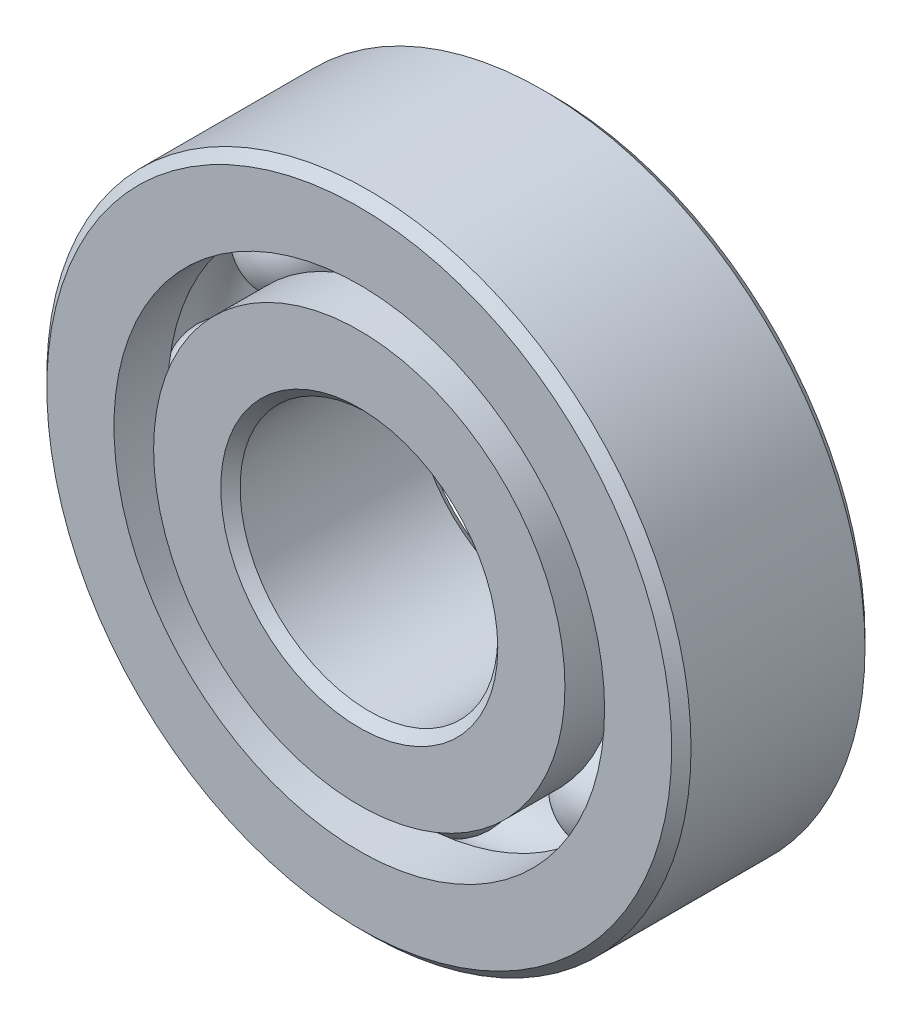
ISO-10303-21;
HEADER;
FILE_DESCRIPTION(('STEP AP214'),'2;1');
FILE_NAME('part.step','',(''),(''),'','','');
FILE_SCHEMA(('AUTOMOTIVE_DESIGN { 1 0 10303 214 1 1 1 1 }'));
ENDSEC;
DATA;
#1=APPLICATION_CONTEXT('core data for automotive mechanical design processes');
#2=APPLICATION_PROTOCOL_DEFINITION('international standard','automotive_design',2000,#1);
#3=PRODUCT_CONTEXT('',#1,'mechanical');
#4=PRODUCT('Part','Part','',(#3));
#5=PRODUCT_RELATED_PRODUCT_CATEGORY('part','',(#4));
#6=PRODUCT_DEFINITION_FORMATION('','',#4);
#7=PRODUCT_DEFINITION_CONTEXT('part definition',#1,'design');
#8=PRODUCT_DEFINITION('design','',#6,#7);
#9=PRODUCT_DEFINITION_SHAPE('','',#8);
#10=(LENGTH_UNIT() NAMED_UNIT(*) SI_UNIT(.MILLI.,.METRE.));
#11=(NAMED_UNIT(*) PLANE_ANGLE_UNIT() SI_UNIT($,.RADIAN.));
#12=(NAMED_UNIT(*) SI_UNIT($,.STERADIAN.) SOLID_ANGLE_UNIT());
#13=UNCERTAINTY_MEASURE_WITH_UNIT(LENGTH_MEASURE(1.E-05),#10,'distance_accuracy_value','');
#14=(GEOMETRIC_REPRESENTATION_CONTEXT(3) GLOBAL_UNCERTAINTY_ASSIGNED_CONTEXT((#13)) GLOBAL_UNIT_ASSIGNED_CONTEXT((#10,
#11,#12)) REPRESENTATION_CONTEXT('',''));
#15=CARTESIAN_POINT('',(0.,0.,0.));
#16=DIRECTION('',(0.,0.,1.));
#17=DIRECTION('',(1.,0.,0.));
#18=AXIS2_PLACEMENT_3D('',#15,#16,#17);
#19=CARTESIAN_POINT('',(-3.92886205296771,3.9288620529678,0.));
#20=DIRECTION('',(0.,0.,1.));
#21=DIRECTION('',(-0.707106781186539,0.707106781186556,0.));
#22=AXIS2_PLACEMENT_3D('',#19,#20,#21);
#23=SPHERICAL_SURFACE('',#22,1.1656174839975);
#24=CARTESIAN_POINT('',(-3.92886205296771,3.9288620529678,1.1656174839975));
#25=VERTEX_POINT('',#24);
#26=VERTEX_LOOP('',#25);
#27=FACE_BOUND('',#26,.T.);
#28=ADVANCED_FACE('F37',(#27),#23,.T.);
#29=CLOSED_SHELL('',(#28));
#30=MANIFOLD_SOLID_BREP('B2',#29);
#31=CARTESIAN_POINT('',(-5.55625,0.,0.));
#32=DIRECTION('',(0.,0.,1.));
#33=DIRECTION('',(-1.,0.,0.));
#34=AXIS2_PLACEMENT_3D('',#31,#32,#33);
#35=SPHERICAL_SURFACE('',#34,1.1656174839975);
#36=CARTESIAN_POINT('',(-5.55625,0.,1.1656174839975));
#37=VERTEX_POINT('',#36);
#38=VERTEX_LOOP('',#37);
#39=FACE_BOUND('',#38,.T.);
#40=ADVANCED_FACE('F57',(#39),#35,.T.);
#41=CLOSED_SHELL('',(#40));
#42=MANIFOLD_SOLID_BREP('B6',#41);
#43=CARTESIAN_POINT('',(-3.92886205296779,-3.92886205296772,0.));
#44=DIRECTION('',(0.,0.,1.));
#45=DIRECTION('',(-0.707106781186554,-0.707106781186541,0.));
#46=AXIS2_PLACEMENT_3D('',#43,#44,#45);
#47=SPHERICAL_SURFACE('',#46,1.1656174839975);
#48=CARTESIAN_POINT('',(-3.92886205296779,-3.92886205296772,1.1656174839975));
#49=VERTEX_POINT('',#48);
#50=VERTEX_LOOP('',#49);
#51=FACE_BOUND('',#50,.T.);
#52=ADVANCED_FACE('F77',(#51),#47,.T.);
#53=CLOSED_SHELL('',(#52));
#54=MANIFOLD_SOLID_BREP('B33',#53);
#55=CARTESIAN_POINT('',(0.,-5.55625,0.));
#56=DIRECTION('',(0.,0.,1.));
#57=DIRECTION('',(0.,-1.,0.));
#58=AXIS2_PLACEMENT_3D('',#55,#56,#57);
#59=SPHERICAL_SURFACE('',#58,1.1656174839975);
#60=CARTESIAN_POINT('',(0.,-5.55625,1.1656174839975));
#61=VERTEX_POINT('',#60);
#62=VERTEX_LOOP('',#61);
#63=FACE_BOUND('',#62,.T.);
#64=ADVANCED_FACE('F97',(#63),#59,.T.);
#65=CLOSED_SHELL('',(#64));
#66=MANIFOLD_SOLID_BREP('B53',#65);
#67=CARTESIAN_POINT('',(3.92886205296773,-3.92886205296777,0.));
#68=DIRECTION('',(0.,0.,1.));
#69=DIRECTION('',(0.707106781186544,-0.707106781186551,0.));
#70=AXIS2_PLACEMENT_3D('',#67,#68,#69);
#71=SPHERICAL_SURFACE('',#70,1.1656174839975);
#72=CARTESIAN_POINT('',(3.92886205296773,-3.92886205296777,1.1656174839975));
#73=VERTEX_POINT('',#72);
#74=VERTEX_LOOP('',#73);
#75=FACE_BOUND('',#74,.T.);
#76=ADVANCED_FACE('F117',(#75),#71,.T.);
#77=CLOSED_SHELL('',(#76));
#78=MANIFOLD_SOLID_BREP('B73',#77);
#79=CARTESIAN_POINT('',(5.55625,0.,0.));
#80=DIRECTION('',(0.,0.,1.));
#81=DIRECTION('',(1.,0.,0.));
#82=AXIS2_PLACEMENT_3D('',#79,#80,#81);
#83=SPHERICAL_SURFACE('',#82,1.1656174839975);
#84=CARTESIAN_POINT('',(5.55625,0.,1.1656174839975));
#85=VERTEX_POINT('',#84);
#86=VERTEX_LOOP('',#85);
#87=FACE_BOUND('',#86,.T.);
#88=ADVANCED_FACE('F137',(#87),#83,.T.);
#89=CLOSED_SHELL('',(#88));
#90=MANIFOLD_SOLID_BREP('B93',#89);
#91=CARTESIAN_POINT('',(3.92886205296776,3.92886205296775,0.));
#92=DIRECTION('',(0.,0.,1.));
#93=DIRECTION('',(0.707106781186549,0.707106781186546,0.));
#94=AXIS2_PLACEMENT_3D('',#91,#92,#93);
#95=SPHERICAL_SURFACE('',#94,1.1656174839975);
#96=CARTESIAN_POINT('',(3.92886205296776,3.92886205296775,1.1656174839975));
#97=VERTEX_POINT('',#96);
#98=VERTEX_LOOP('',#97);
#99=FACE_BOUND('',#98,.T.);
#100=ADVANCED_FACE('F157',(#99),#95,.T.);
#101=CLOSED_SHELL('',(#100));
#102=MANIFOLD_SOLID_BREP('B113',#101);
#103=CARTESIAN_POINT('',(0.,5.55625,0.));
#104=DIRECTION('',(0.,0.,1.));
#105=DIRECTION('',(0.,1.,0.));
#106=AXIS2_PLACEMENT_3D('',#103,#104,#105);
#107=SPHERICAL_SURFACE('',#106,1.1656174839975);
#108=CARTESIAN_POINT('',(0.,5.55625,1.1656174839975));
#109=VERTEX_POINT('',#108);
#110=VERTEX_LOOP('',#109);
#111=FACE_BOUND('',#110,.T.);
#112=ADVANCED_FACE('F179',(#111),#107,.T.);
#113=CLOSED_SHELL('',(#112));
#114=MANIFOLD_SOLID_BREP('B133',#113);
#115=CARTESIAN_POINT('',(0.,5.06778846153846,2.38125));
#116=DIRECTION('',(0.,0.,-1.));
#117=DIRECTION('',(-1.,0.,0.));
#118=AXIS2_PLACEMENT_3D('',#115,#116,#117);
#119=PLANE('',#118);
#120=CARTESIAN_POINT('',(0.,0.,2.38125));
#121=DIRECTION('',(0.,0.,1.));
#122=DIRECTION('',(1.,0.,0.));
#123=AXIS2_PLACEMENT_3D('',#120,#121,#122);
#124=CIRCLE('',#123,3.413125);
#125=CARTESIAN_POINT('',(3.413125,0.,2.38125));
#126=VERTEX_POINT('',#125);
#127=EDGE_CURVE('E226',#126,#126,#124,.T.);
#128=ORIENTED_EDGE('',*,*,#127,.F.);
#129=EDGE_LOOP('',(#128));
#130=FACE_BOUND('',#129,.T.);
#131=CARTESIAN_POINT('',(0.,0.,2.38125));
#132=DIRECTION('',(0.,0.,1.));
#133=DIRECTION('',(1.,0.,0.));
#134=AXIS2_PLACEMENT_3D('',#131,#132,#133);
#135=CIRCLE('',#134,5.06778846153846);
#136=CARTESIAN_POINT('',(5.06778846153846,0.,2.38125));
#137=VERTEX_POINT('',#136);
#138=EDGE_CURVE('E178',#137,#137,#135,.T.);
#139=ORIENTED_EDGE('',*,*,#138,.T.);
#140=EDGE_LOOP('',(#139));
#141=FACE_BOUND('',#140,.T.);
#142=ADVANCED_FACE('F198',(#130,#141),#119,.F.);
#143=CARTESIAN_POINT('',(0.,0.,2.38125));
#144=DIRECTION('',(0.,0.,1.));
#145=DIRECTION('',(1.,0.,0.));
#146=AXIS2_PLACEMENT_3D('',#143,#144,#145);
#147=CYLINDRICAL_SURFACE('',#146,5.06778846153846);
#148=ORIENTED_EDGE('',*,*,#138,.F.);
#149=EDGE_LOOP('',(#148));
#150=FACE_BOUND('',#149,.T.);
#151=CARTESIAN_POINT('',(0.,0.,1.05833333333333));
#152=DIRECTION('',(0.,0.,1.));
#153=DIRECTION('',(1.,0.,0.));
#154=AXIS2_PLACEMENT_3D('',#151,#152,#153);
#155=CIRCLE('',#154,5.06778846153846);
#156=CARTESIAN_POINT('',(5.06778846153846,0.,1.05833333333333));
#157=VERTEX_POINT('',#156);
#158=EDGE_CURVE('E204',#157,#157,#155,.T.);
#159=ORIENTED_EDGE('',*,*,#158,.T.);
#160=EDGE_LOOP('',(#159));
#161=FACE_BOUND('',#160,.T.);
#162=ADVANCED_FACE('F233',(#150,#161),#147,.T.);
#163=CARTESIAN_POINT('',(0.,0.,0.));
#164=DIRECTION('',(0.,0.,1.));
#165=DIRECTION('',(1.,0.,0.));
#166=AXIS2_PLACEMENT_3D('',#163,#164,#165);
#167=TOROIDAL_SURFACE('',#166,5.55625,1.16561748399749);
#168=ORIENTED_EDGE('',*,*,#158,.F.);
#169=EDGE_LOOP('',(#168));
#170=FACE_BOUND('',#169,.T.);
#171=CARTESIAN_POINT('',(0.,0.,-1.05833333333333));
#172=DIRECTION('',(0.,0.,1.));
#173=DIRECTION('',(1.,0.,0.));
#174=AXIS2_PLACEMENT_3D('',#171,#172,#173);
#175=CIRCLE('',#174,5.06778846153846);
#176=CARTESIAN_POINT('',(5.06778846153846,0.,-1.05833333333333));
#177=VERTEX_POINT('',#176);
#178=EDGE_CURVE('E208',#177,#177,#175,.T.);
#179=ORIENTED_EDGE('',*,*,#178,.T.);
#180=EDGE_LOOP('',(#179));
#181=FACE_BOUND('',#180,.T.);
#182=ADVANCED_FACE('F237',(#170,#181),#167,.F.);
#183=CARTESIAN_POINT('',(0.,0.,2.38125));
#184=DIRECTION('',(0.,0.,1.));
#185=DIRECTION('',(1.,0.,0.));
#186=AXIS2_PLACEMENT_3D('',#183,#184,#185);
#187=CYLINDRICAL_SURFACE('',#186,5.06778846153846);
#188=ORIENTED_EDGE('',*,*,#178,.F.);
#189=EDGE_LOOP('',(#188));
#190=FACE_BOUND('',#189,.T.);
#191=CARTESIAN_POINT('',(0.,0.,-2.38125));
#192=DIRECTION('',(0.,0.,1.));
#193=DIRECTION('',(1.,0.,0.));
#194=AXIS2_PLACEMENT_3D('',#191,#192,#193);
#195=CIRCLE('',#194,5.06778846153846);
#196=CARTESIAN_POINT('',(5.06778846153846,0.,-2.38125));
#197=VERTEX_POINT('',#196);
#198=EDGE_CURVE('E212',#197,#197,#195,.T.);
#199=ORIENTED_EDGE('',*,*,#198,.T.);
#200=EDGE_LOOP('',(#199));
#201=FACE_BOUND('',#200,.T.);
#202=ADVANCED_FACE('F242',(#190,#201),#187,.T.);
#203=CARTESIAN_POINT('',(0.,3.413125,-2.38125000000001));
#204=DIRECTION('',(0.,0.,1.));
#205=DIRECTION('',(1.,0.,0.));
#206=AXIS2_PLACEMENT_3D('',#203,#204,#205);
#207=PLANE('',#206);
#208=ORIENTED_EDGE('',*,*,#198,.F.);
#209=EDGE_LOOP('',(#208));
#210=FACE_BOUND('',#209,.T.);
#211=CARTESIAN_POINT('',(0.,0.,-2.38125000000001));
#212=DIRECTION('',(0.,0.,1.));
#213=DIRECTION('',(1.,0.,0.));
#214=AXIS2_PLACEMENT_3D('',#211,#212,#213);
#215=CIRCLE('',#214,3.413125);
#216=CARTESIAN_POINT('',(3.413125,0.,-2.38125000000001));
#217=VERTEX_POINT('',#216);
#218=EDGE_CURVE('E217',#217,#217,#215,.T.);
#219=ORIENTED_EDGE('',*,*,#218,.T.);
#220=EDGE_LOOP('',(#219));
#221=FACE_BOUND('',#220,.T.);
#222=ADVANCED_FACE('F248',(#210,#221),#207,.F.);
#223=CARTESIAN_POINT('',(0.,0.,-2.14312500000001));
#224=DIRECTION('',(0.,0.,-1.));
#225=DIRECTION('',(-1.,0.,0.));
#226=AXIS2_PLACEMENT_3D('',#223,#224,#225);
#227=CONICAL_SURFACE('',#226,3.175,0.785398163397443);
#228=ORIENTED_EDGE('',*,*,#218,.F.);
#229=EDGE_LOOP('',(#228));
#230=FACE_BOUND('',#229,.T.);
#231=CARTESIAN_POINT('',(0.,0.,-2.14312500000001));
#232=DIRECTION('',(0.,0.,1.));
#233=DIRECTION('',(1.,0.,0.));
#234=AXIS2_PLACEMENT_3D('',#231,#232,#233);
#235=CIRCLE('',#234,3.175);
#236=CARTESIAN_POINT('',(3.175,0.,-2.14312500000001));
#237=VERTEX_POINT('',#236);
#238=EDGE_CURVE('E220',#237,#237,#235,.T.);
#239=ORIENTED_EDGE('',*,*,#238,.T.);
#240=EDGE_LOOP('',(#239));
#241=FACE_BOUND('',#240,.T.);
#242=ADVANCED_FACE('F252',(#230,#241),#227,.F.);
#243=CARTESIAN_POINT('',(0.,0.,2.38125));
#244=DIRECTION('',(0.,0.,1.));
#245=DIRECTION('',(1.,0.,0.));
#246=AXIS2_PLACEMENT_3D('',#243,#244,#245);
#247=CYLINDRICAL_SURFACE('',#246,3.175);
#248=ORIENTED_EDGE('',*,*,#238,.F.);
#249=EDGE_LOOP('',(#248));
#250=FACE_BOUND('',#249,.T.);
#251=CARTESIAN_POINT('',(0.,0.,2.14312500000001));
#252=DIRECTION('',(0.,0.,1.));
#253=DIRECTION('',(1.,0.,0.));
#254=AXIS2_PLACEMENT_3D('',#251,#252,#253);
#255=CIRCLE('',#254,3.175);
#256=CARTESIAN_POINT('',(3.175,0.,2.14312500000001));
#257=VERTEX_POINT('',#256);
#258=EDGE_CURVE('E223',#257,#257,#255,.T.);
#259=ORIENTED_EDGE('',*,*,#258,.T.);
#260=EDGE_LOOP('',(#259));
#261=FACE_BOUND('',#260,.T.);
#262=ADVANCED_FACE('F256',(#250,#261),#247,.F.);
#263=CARTESIAN_POINT('',(0.,0.,2.38125));
#264=DIRECTION('',(0.,0.,1.));
#265=DIRECTION('',(1.,0.,0.));
#266=AXIS2_PLACEMENT_3D('',#263,#264,#265);
#267=CONICAL_SURFACE('',#266,3.413125,0.785398163397459);
#268=ORIENTED_EDGE('',*,*,#258,.F.);
#269=EDGE_LOOP('',(#268));
#270=FACE_BOUND('',#269,.T.);
#271=ORIENTED_EDGE('',*,*,#127,.T.);
#272=EDGE_LOOP('',(#271));
#273=FACE_BOUND('',#272,.T.);
#274=ADVANCED_FACE('F230',(#270,#273),#267,.F.);
#275=CLOSED_SHELL('',(#142,#162,#182,#202,#222,#242,#262,#274));
#276=MANIFOLD_SOLID_BREP('B153',#275);
#277=CARTESIAN_POINT('',(0.,0.,2.143125));
#278=DIRECTION('',(0.,0.,-1.));
#279=DIRECTION('',(-1.,0.,0.));
#280=AXIS2_PLACEMENT_3D('',#277,#278,#279);
#281=CONICAL_SURFACE('',#280,7.9375,0.785398163397446);
#282=CARTESIAN_POINT('',(0.,0.,2.38125));
#283=DIRECTION('',(0.,0.,1.));
#284=DIRECTION('',(1.,0.,0.));
#285=AXIS2_PLACEMENT_3D('',#282,#283,#284);
#286=CIRCLE('',#285,7.699375);
#287=CARTESIAN_POINT('',(7.699375,0.,2.38125));
#288=VERTEX_POINT('',#287);
#289=EDGE_CURVE('E347',#288,#288,#286,.T.);
#290=ORIENTED_EDGE('',*,*,#289,.F.);
#291=EDGE_LOOP('',(#290));
#292=FACE_BOUND('',#291,.T.);
#293=CARTESIAN_POINT('',(0.,0.,2.143125));
#294=DIRECTION('',(0.,0.,1.));
#295=DIRECTION('',(1.,0.,0.));
#296=AXIS2_PLACEMENT_3D('',#293,#294,#295);
#297=CIRCLE('',#296,7.9375);
#298=CARTESIAN_POINT('',(7.9375,0.,2.143125));
#299=VERTEX_POINT('',#298);
#300=EDGE_CURVE('E197',#299,#299,#297,.T.);
#301=ORIENTED_EDGE('',*,*,#300,.T.);
#302=EDGE_LOOP('',(#301));
#303=FACE_BOUND('',#302,.T.);
#304=ADVANCED_FACE('F319',(#292,#303),#281,.T.);
#305=CARTESIAN_POINT('',(0.,0.,2.38125));
#306=DIRECTION('',(0.,0.,1.));
#307=DIRECTION('',(1.,0.,0.));
#308=AXIS2_PLACEMENT_3D('',#305,#306,#307);
#309=CYLINDRICAL_SURFACE('',#308,7.9375);
#310=ORIENTED_EDGE('',*,*,#300,.F.);
#311=EDGE_LOOP('',(#310));
#312=FACE_BOUND('',#311,.T.);
#313=CARTESIAN_POINT('',(0.,0.,-2.14312500000001));
#314=DIRECTION('',(0.,0.,1.));
#315=DIRECTION('',(1.,0.,0.));
#316=AXIS2_PLACEMENT_3D('',#313,#314,#315);
#317=CIRCLE('',#316,7.9375);
#318=CARTESIAN_POINT('',(7.9375,0.,-2.14312500000001));
#319=VERTEX_POINT('',#318);
#320=EDGE_CURVE('E325',#319,#319,#317,.T.);
#321=ORIENTED_EDGE('',*,*,#320,.T.);
#322=EDGE_LOOP('',(#321));
#323=FACE_BOUND('',#322,.T.);
#324=ADVANCED_FACE('F354',(#312,#323),#309,.T.);
#325=CARTESIAN_POINT('',(0.,0.,-2.38125000000001));
#326=DIRECTION('',(0.,0.,1.));
#327=DIRECTION('',(1.,0.,0.));
#328=AXIS2_PLACEMENT_3D('',#325,#326,#327);
#329=CONICAL_SURFACE('',#328,7.699375,0.785398163397445);
#330=ORIENTED_EDGE('',*,*,#320,.F.);
#331=EDGE_LOOP('',(#330));
#332=FACE_BOUND('',#331,.T.);
#333=CARTESIAN_POINT('',(0.,0.,-2.38125000000001));
#334=DIRECTION('',(0.,0.,1.));
#335=DIRECTION('',(1.,0.,0.));
#336=AXIS2_PLACEMENT_3D('',#333,#334,#335);
#337=CIRCLE('',#336,7.699375);
#338=CARTESIAN_POINT('',(7.699375,0.,-2.38125000000001));
#339=VERTEX_POINT('',#338);
#340=EDGE_CURVE('E329',#339,#339,#337,.T.);
#341=ORIENTED_EDGE('',*,*,#340,.T.);
#342=EDGE_LOOP('',(#341));
#343=FACE_BOUND('',#342,.T.);
#344=ADVANCED_FACE('F358',(#332,#343),#329,.T.);
#345=CARTESIAN_POINT('',(0.,7.699375,-2.38125000000001));
#346=DIRECTION('',(0.,0.,1.));
#347=DIRECTION('',(1.,0.,0.));
#348=AXIS2_PLACEMENT_3D('',#345,#346,#347);
#349=PLANE('',#348);
#350=ORIENTED_EDGE('',*,*,#340,.F.);
#351=EDGE_LOOP('',(#350));
#352=FACE_BOUND('',#351,.T.);
#353=CARTESIAN_POINT('',(0.,0.,-2.38125000000001));
#354=DIRECTION('',(0.,0.,1.));
#355=DIRECTION('',(1.,0.,0.));
#356=AXIS2_PLACEMENT_3D('',#353,#354,#355);
#357=CIRCLE('',#356,6.04471153846154);
#358=CARTESIAN_POINT('',(6.04471153846154,0.,-2.38125000000001));
#359=VERTEX_POINT('',#358);
#360=EDGE_CURVE('E333',#359,#359,#357,.T.);
#361=ORIENTED_EDGE('',*,*,#360,.T.);
#362=EDGE_LOOP('',(#361));
#363=FACE_BOUND('',#362,.T.);
#364=ADVANCED_FACE('F363',(#352,#363),#349,.F.);
#365=CARTESIAN_POINT('',(0.,0.,2.38125));
#366=DIRECTION('',(0.,0.,1.));
#367=DIRECTION('',(1.,0.,0.));
#368=AXIS2_PLACEMENT_3D('',#365,#366,#367);
#369=CYLINDRICAL_SURFACE('',#368,6.04471153846154);
#370=ORIENTED_EDGE('',*,*,#360,.F.);
#371=EDGE_LOOP('',(#370));
#372=FACE_BOUND('',#371,.T.);
#373=CARTESIAN_POINT('',(0.,0.,-1.05833333333334));
#374=DIRECTION('',(0.,0.,1.));
#375=DIRECTION('',(1.,0.,0.));
#376=AXIS2_PLACEMENT_3D('',#373,#374,#375);
#377=CIRCLE('',#376,6.04471153846154);
#378=CARTESIAN_POINT('',(6.04471153846154,0.,-1.05833333333334));
#379=VERTEX_POINT('',#378);
#380=EDGE_CURVE('E338',#379,#379,#377,.T.);
#381=ORIENTED_EDGE('',*,*,#380,.T.);
#382=EDGE_LOOP('',(#381));
#383=FACE_BOUND('',#382,.T.);
#384=ADVANCED_FACE('F369',(#372,#383),#369,.F.);
#385=CARTESIAN_POINT('',(0.,0.,0.));
#386=DIRECTION('',(0.,0.,1.));
#387=DIRECTION('',(1.,0.,0.));
#388=AXIS2_PLACEMENT_3D('',#385,#386,#387);
#389=TOROIDAL_SURFACE('',#388,5.55625,1.1656174839975);
#390=ORIENTED_EDGE('',*,*,#380,.F.);
#391=EDGE_LOOP('',(#390));
#392=FACE_BOUND('',#391,.T.);
#393=CARTESIAN_POINT('',(0.,0.,1.05833333333333));
#394=DIRECTION('',(0.,0.,1.));
#395=DIRECTION('',(1.,0.,0.));
#396=AXIS2_PLACEMENT_3D('',#393,#394,#395);
#397=CIRCLE('',#396,6.04471153846154);
#398=CARTESIAN_POINT('',(6.04471153846154,0.,1.05833333333333));
#399=VERTEX_POINT('',#398);
#400=EDGE_CURVE('E341',#399,#399,#397,.T.);
#401=ORIENTED_EDGE('',*,*,#400,.T.);
#402=EDGE_LOOP('',(#401));
#403=FACE_BOUND('',#402,.T.);
#404=ADVANCED_FACE('F373',(#392,#403),#389,.F.);
#405=CARTESIAN_POINT('',(0.,0.,2.38125));
#406=DIRECTION('',(0.,0.,1.));
#407=DIRECTION('',(1.,0.,0.));
#408=AXIS2_PLACEMENT_3D('',#405,#406,#407);
#409=CYLINDRICAL_SURFACE('',#408,6.04471153846154);
#410=ORIENTED_EDGE('',*,*,#400,.F.);
#411=EDGE_LOOP('',(#410));
#412=FACE_BOUND('',#411,.T.);
#413=CARTESIAN_POINT('',(0.,0.,2.38125));
#414=DIRECTION('',(0.,0.,1.));
#415=DIRECTION('',(1.,0.,0.));
#416=AXIS2_PLACEMENT_3D('',#413,#414,#415);
#417=CIRCLE('',#416,6.04471153846154);
#418=CARTESIAN_POINT('',(6.04471153846154,0.,2.38125));
#419=VERTEX_POINT('',#418);
#420=EDGE_CURVE('E344',#419,#419,#417,.T.);
#421=ORIENTED_EDGE('',*,*,#420,.T.);
#422=EDGE_LOOP('',(#421));
#423=FACE_BOUND('',#422,.T.);
#424=ADVANCED_FACE('F377',(#412,#423),#409,.F.);
#425=CARTESIAN_POINT('',(0.,7.699375,2.38125));
#426=DIRECTION('',(0.,0.,-1.));
#427=DIRECTION('',(-1.,0.,0.));
#428=AXIS2_PLACEMENT_3D('',#425,#426,#427);
#429=PLANE('',#428);
#430=ORIENTED_EDGE('',*,*,#420,.F.);
#431=EDGE_LOOP('',(#430));
#432=FACE_BOUND('',#431,.T.);
#433=ORIENTED_EDGE('',*,*,#289,.T.);
#434=EDGE_LOOP('',(#433));
#435=FACE_BOUND('',#434,.T.);
#436=ADVANCED_FACE('F351',(#432,#435),#429,.F.);
#437=CLOSED_SHELL('',(#304,#324,#344,#364,#384,#404,#424,#436));
#438=MANIFOLD_SOLID_BREP('B173',#437);
#439=ADVANCED_BREP_SHAPE_REPRESENTATION('',(#18,#30,#42,#54,#66,#78,#90,#102,#114,#276,#438),#14);
#440=SHAPE_DEFINITION_REPRESENTATION(#9,#439);
ENDSEC;
END-ISO-10303-21;
